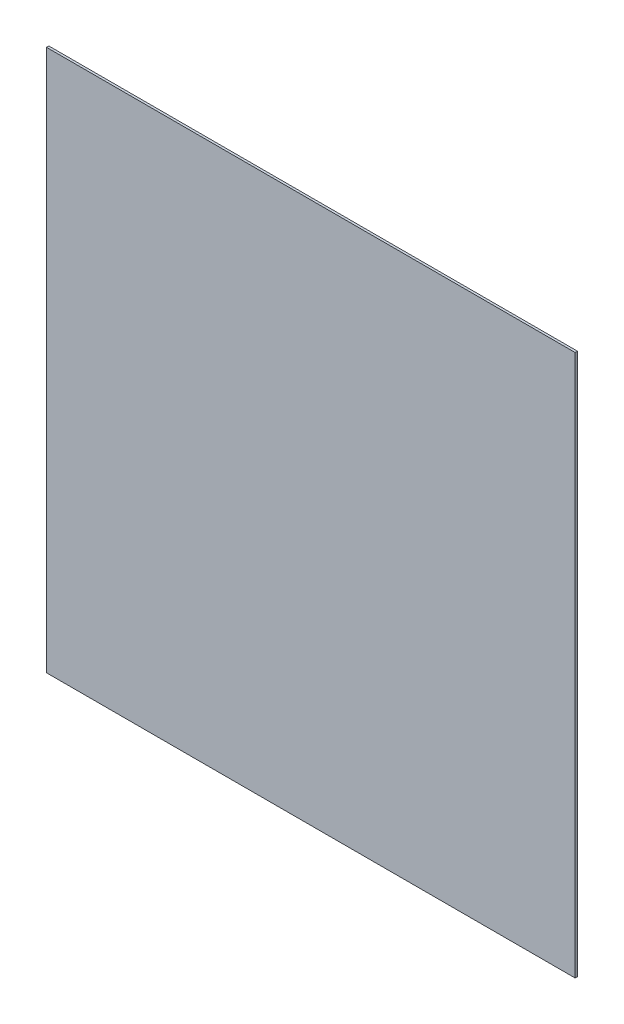
ISO-10303-21;
HEADER;
FILE_DESCRIPTION(('STEP AP214'),'2;1');
FILE_NAME('part.step','',(''),(''),'','','');
FILE_SCHEMA(('AUTOMOTIVE_DESIGN { 1 0 10303 214 1 1 1 1 }'));
ENDSEC;
DATA;
#1=APPLICATION_CONTEXT('core data for automotive mechanical design processes');
#2=APPLICATION_PROTOCOL_DEFINITION('international standard','automotive_design',2000,#1);
#3=PRODUCT_CONTEXT('',#1,'mechanical');
#4=PRODUCT('Part','Part','',(#3));
#5=PRODUCT_RELATED_PRODUCT_CATEGORY('part','',(#4));
#6=PRODUCT_DEFINITION_FORMATION('','',#4);
#7=PRODUCT_DEFINITION_CONTEXT('part definition',#1,'design');
#8=PRODUCT_DEFINITION('design','',#6,#7);
#9=PRODUCT_DEFINITION_SHAPE('','',#8);
#10=(LENGTH_UNIT() NAMED_UNIT(*) SI_UNIT(.MILLI.,.METRE.));
#11=(NAMED_UNIT(*) PLANE_ANGLE_UNIT() SI_UNIT($,.RADIAN.));
#12=(NAMED_UNIT(*) SI_UNIT($,.STERADIAN.) SOLID_ANGLE_UNIT());
#13=UNCERTAINTY_MEASURE_WITH_UNIT(LENGTH_MEASURE(1.E-05),#10,'distance_accuracy_value','');
#14=(GEOMETRIC_REPRESENTATION_CONTEXT(3) GLOBAL_UNCERTAINTY_ASSIGNED_CONTEXT((#13)) GLOBAL_UNIT_ASSIGNED_CONTEXT((#10,
#11,#12)) REPRESENTATION_CONTEXT('',''));
#15=CARTESIAN_POINT('',(0.,0.,0.));
#16=DIRECTION('',(0.,0.,1.));
#17=DIRECTION('',(1.,0.,0.));
#18=AXIS2_PLACEMENT_3D('',#15,#16,#17);
#19=CARTESIAN_POINT('',(170.25,-174.5,-1.5));
#20=DIRECTION('',(1.,0.,0.));
#21=DIRECTION('',(0.,0.,-1.));
#22=AXIS2_PLACEMENT_3D('',#19,#20,#21);
#23=PLANE('',#22);
#24=DIRECTION('',(0.,1.,0.));
#25=VECTOR('',#24,1.);
#26=CARTESIAN_POINT('',(170.25,-174.5,0.));
#27=LINE('',#26,#25);
#28=CARTESIAN_POINT('',(170.25,-174.5,0.));
#29=VERTEX_POINT('',#28);
#30=CARTESIAN_POINT('',(170.25,174.5,0.));
#31=VERTEX_POINT('',#30);
#32=EDGE_CURVE('E102',#29,#31,#27,.T.);
#33=ORIENTED_EDGE('',*,*,#32,.F.);
#34=DIRECTION('',(0.,0.,1.));
#35=VECTOR('',#34,1.);
#36=CARTESIAN_POINT('',(170.25,-174.5,-1.5));
#37=LINE('',#36,#35);
#38=CARTESIAN_POINT('',(170.25,-174.5,-1.5));
#39=VERTEX_POINT('',#38);
#40=EDGE_CURVE('E11',#39,#29,#37,.T.);
#41=ORIENTED_EDGE('',*,*,#40,.F.);
#42=DIRECTION('',(0.,1.,0.));
#43=VECTOR('',#42,1.);
#44=CARTESIAN_POINT('',(170.25,-174.5,-1.5));
#45=LINE('',#44,#43);
#46=CARTESIAN_POINT('',(170.25,174.5,-1.5));
#47=VERTEX_POINT('',#46);
#48=EDGE_CURVE('E96',#39,#47,#45,.T.);
#49=ORIENTED_EDGE('',*,*,#48,.T.);
#50=DIRECTION('',(0.,0.,1.));
#51=VECTOR('',#50,1.);
#52=CARTESIAN_POINT('',(170.25,174.5,-1.5));
#53=LINE('',#52,#51);
#54=EDGE_CURVE('E41',#47,#31,#53,.T.);
#55=ORIENTED_EDGE('',*,*,#54,.T.);
#56=EDGE_LOOP('',(#33,#41,#49,#55));
#57=FACE_BOUND('',#56,.T.);
#58=ADVANCED_FACE('F38',(#57),#23,.T.);
#59=CARTESIAN_POINT('',(-170.25,-174.5,-1.5));
#60=DIRECTION('',(0.,-1.,0.));
#61=DIRECTION('',(0.,0.,-1.));
#62=AXIS2_PLACEMENT_3D('',#59,#60,#61);
#63=PLANE('',#62);
#64=DIRECTION('',(1.,0.,0.));
#65=VECTOR('',#64,1.);
#66=CARTESIAN_POINT('',(-170.25,-174.5,0.));
#67=LINE('',#66,#65);
#68=CARTESIAN_POINT('',(-170.25,-174.5,0.));
#69=VERTEX_POINT('',#68);
#70=EDGE_CURVE('E98',#69,#29,#67,.T.);
#71=ORIENTED_EDGE('',*,*,#70,.F.);
#72=DIRECTION('',(0.,0.,1.));
#73=VECTOR('',#72,1.);
#74=CARTESIAN_POINT('',(-170.25,-174.5,-1.5));
#75=LINE('',#74,#73);
#76=CARTESIAN_POINT('',(-170.25,-174.5,-1.5));
#77=VERTEX_POINT('',#76);
#78=EDGE_CURVE('E47',#77,#69,#75,.T.);
#79=ORIENTED_EDGE('',*,*,#78,.F.);
#80=DIRECTION('',(1.,0.,0.));
#81=VECTOR('',#80,1.);
#82=CARTESIAN_POINT('',(-170.25,-174.5,-1.5));
#83=LINE('',#82,#81);
#84=EDGE_CURVE('E93',#77,#39,#83,.T.);
#85=ORIENTED_EDGE('',*,*,#84,.T.);
#86=ORIENTED_EDGE('',*,*,#40,.T.);
#87=EDGE_LOOP('',(#71,#79,#85,#86));
#88=FACE_BOUND('',#87,.T.);
#89=ADVANCED_FACE('F112',(#88),#63,.T.);
#90=CARTESIAN_POINT('',(-170.25,-174.5,-1.5));
#91=DIRECTION('',(-1.,0.,0.));
#92=DIRECTION('',(0.,0.,1.));
#93=AXIS2_PLACEMENT_3D('',#90,#91,#92);
#94=PLANE('',#93);
#95=DIRECTION('',(0.,-1.,0.));
#96=VECTOR('',#95,1.);
#97=CARTESIAN_POINT('',(-170.25,-174.5,0.));
#98=LINE('',#97,#96);
#99=CARTESIAN_POINT('',(-170.25,174.5,0.));
#100=VERTEX_POINT('',#99);
#101=EDGE_CURVE('E88',#100,#69,#98,.T.);
#102=ORIENTED_EDGE('',*,*,#101,.F.);
#103=DIRECTION('',(0.,0.,1.));
#104=VECTOR('',#103,1.);
#105=CARTESIAN_POINT('',(-170.25,174.5,-1.5));
#106=LINE('',#105,#104);
#107=CARTESIAN_POINT('',(-170.25,174.5,-1.5));
#108=VERTEX_POINT('',#107);
#109=EDGE_CURVE('E83',#108,#100,#106,.T.);
#110=ORIENTED_EDGE('',*,*,#109,.F.);
#111=DIRECTION('',(0.,-1.,0.));
#112=VECTOR('',#111,1.);
#113=CARTESIAN_POINT('',(-170.25,-174.5,-1.5));
#114=LINE('',#113,#112);
#115=EDGE_CURVE('E86',#108,#77,#114,.T.);
#116=ORIENTED_EDGE('',*,*,#115,.T.);
#117=ORIENTED_EDGE('',*,*,#78,.T.);
#118=EDGE_LOOP('',(#102,#110,#116,#117));
#119=FACE_BOUND('',#118,.T.);
#120=ADVANCED_FACE('F85',(#119),#94,.T.);
#121=CARTESIAN_POINT('',(-170.25,174.5,-1.5));
#122=DIRECTION('',(0.,1.,0.));
#123=DIRECTION('',(0.,0.,1.));
#124=AXIS2_PLACEMENT_3D('',#121,#122,#123);
#125=PLANE('',#124);
#126=DIRECTION('',(-1.,0.,0.));
#127=VECTOR('',#126,1.);
#128=CARTESIAN_POINT('',(-170.25,174.5,0.));
#129=LINE('',#128,#127);
#130=EDGE_CURVE('E105',#31,#100,#129,.T.);
#131=ORIENTED_EDGE('',*,*,#130,.F.);
#132=ORIENTED_EDGE('',*,*,#54,.F.);
#133=DIRECTION('',(-1.,0.,0.));
#134=VECTOR('',#133,1.);
#135=CARTESIAN_POINT('',(-170.25,174.5,-1.5));
#136=LINE('',#135,#134);
#137=EDGE_CURVE('E92',#47,#108,#136,.T.);
#138=ORIENTED_EDGE('',*,*,#137,.T.);
#139=ORIENTED_EDGE('',*,*,#109,.T.);
#140=EDGE_LOOP('',(#131,#132,#138,#139));
#141=FACE_BOUND('',#140,.T.);
#142=ADVANCED_FACE('F95',(#141),#125,.T.);
#143=CARTESIAN_POINT('',(0.,0.,-1.5));
#144=DIRECTION('',(0.,0.,-1.));
#145=DIRECTION('',(-1.,0.,0.));
#146=AXIS2_PLACEMENT_3D('',#143,#144,#145);
#147=PLANE('',#146);
#148=ORIENTED_EDGE('',*,*,#48,.F.);
#149=ORIENTED_EDGE('',*,*,#84,.F.);
#150=ORIENTED_EDGE('',*,*,#115,.F.);
#151=ORIENTED_EDGE('',*,*,#137,.F.);
#152=EDGE_LOOP('',(#148,#149,#150,#151));
#153=FACE_BOUND('',#152,.T.);
#154=ADVANCED_FACE('F91',(#153),#147,.T.);
#155=CARTESIAN_POINT('',(0.,0.,0.));
#156=DIRECTION('',(0.,0.,-1.));
#157=DIRECTION('',(-1.,0.,0.));
#158=AXIS2_PLACEMENT_3D('',#155,#156,#157);
#159=PLANE('',#158);
#160=ORIENTED_EDGE('',*,*,#32,.T.);
#161=ORIENTED_EDGE('',*,*,#130,.T.);
#162=ORIENTED_EDGE('',*,*,#101,.T.);
#163=ORIENTED_EDGE('',*,*,#70,.T.);
#164=EDGE_LOOP('',(#160,#161,#162,#163));
#165=FACE_BOUND('',#164,.T.);
#166=ADVANCED_FACE('F111',(#165),#159,.F.);
#167=CLOSED_SHELL('',(#58,#89,#120,#142,#154,#166));
#168=MANIFOLD_SOLID_BREP('B2',#167);
#169=ADVANCED_BREP_SHAPE_REPRESENTATION('',(#18,#168),#14);
#170=SHAPE_DEFINITION_REPRESENTATION(#9,#169);
ENDSEC;
END-ISO-10303-21;
